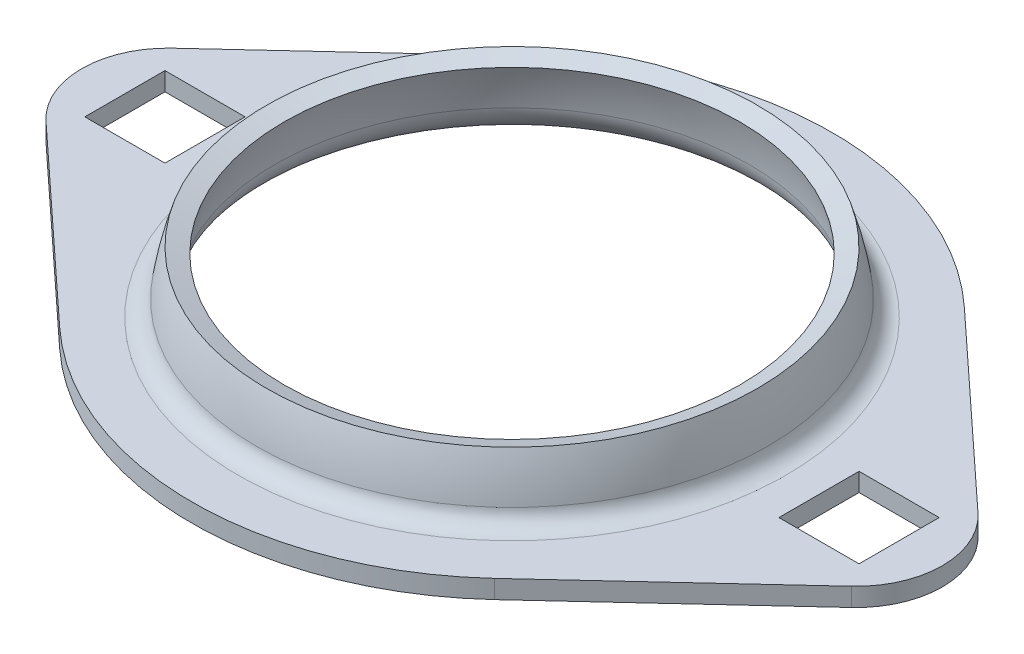
ISO-10303-21;
HEADER;
FILE_DESCRIPTION(('STEP AP214'),'2;1');
FILE_NAME('part.step','',(''),(''),'','','');
FILE_SCHEMA(('AUTOMOTIVE_DESIGN { 1 0 10303 214 1 1 1 1 }'));
ENDSEC;
DATA;
#1=APPLICATION_CONTEXT('core data for automotive mechanical design processes');
#2=APPLICATION_PROTOCOL_DEFINITION('international standard','automotive_design',2000,#1);
#3=PRODUCT_CONTEXT('',#1,'mechanical');
#4=PRODUCT('Part','Part','',(#3));
#5=PRODUCT_RELATED_PRODUCT_CATEGORY('part','',(#4));
#6=PRODUCT_DEFINITION_FORMATION('','',#4);
#7=PRODUCT_DEFINITION_CONTEXT('part definition',#1,'design');
#8=PRODUCT_DEFINITION('design','',#6,#7);
#9=PRODUCT_DEFINITION_SHAPE('','',#8);
#10=(LENGTH_UNIT() NAMED_UNIT(*) SI_UNIT(.MILLI.,.METRE.));
#11=(NAMED_UNIT(*) PLANE_ANGLE_UNIT() SI_UNIT($,.RADIAN.));
#12=(NAMED_UNIT(*) SI_UNIT($,.STERADIAN.) SOLID_ANGLE_UNIT());
#13=UNCERTAINTY_MEASURE_WITH_UNIT(LENGTH_MEASURE(1.E-05),#10,'distance_accuracy_value','');
#14=(GEOMETRIC_REPRESENTATION_CONTEXT(3) GLOBAL_UNCERTAINTY_ASSIGNED_CONTEXT((#13)) GLOBAL_UNIT_ASSIGNED_CONTEXT((#10,
#11,#12)) REPRESENTATION_CONTEXT('',''));
#15=CARTESIAN_POINT('',(0.,0.,0.));
#16=DIRECTION('',(0.,0.,1.));
#17=DIRECTION('',(1.,0.,0.));
#18=AXIS2_PLACEMENT_3D('',#15,#16,#17);
#19=CARTESIAN_POINT('',(34.75,10.5,0.));
#20=DIRECTION('',(0.,1.,0.));
#21=DIRECTION('',(0.,0.,1.));
#22=AXIS2_PLACEMENT_3D('',#19,#20,#21);
#23=PLANE('',#22);
#24=DIRECTION('',(0.,0.,1.));
#25=VECTOR('',#24,1.);
#26=CARTESIAN_POINT('',(-42.0249999999999,10.5,0.));
#27=LINE('',#26,#25);
#28=CARTESIAN_POINT('',(-42.0249999999999,10.5,-4.35));
#29=VERTEX_POINT('',#28);
#30=CARTESIAN_POINT('',(-42.0249999999999,10.5,4.35));
#31=VERTEX_POINT('',#30);
#32=EDGE_CURVE('E245',#29,#31,#27,.T.);
#33=ORIENTED_EDGE('',*,*,#32,.F.);
#34=DIRECTION('',(-1.,0.,0.));
#35=VECTOR('',#34,1.);
#36=CARTESIAN_POINT('',(34.75,10.5,-4.35000000000002));
#37=LINE('',#36,#35);
#38=CARTESIAN_POINT('',(-33.3249999999999,10.5,-4.35));
#39=VERTEX_POINT('',#38);
#40=EDGE_CURVE('E239',#39,#29,#37,.T.);
#41=ORIENTED_EDGE('',*,*,#40,.F.);
#42=DIRECTION('',(0.,0.,1.));
#43=VECTOR('',#42,1.);
#44=CARTESIAN_POINT('',(-33.3249999999999,10.5,0.));
#45=LINE('',#44,#43);
#46=CARTESIAN_POINT('',(-33.3249999999999,10.5,4.35));
#47=VERTEX_POINT('',#46);
#48=EDGE_CURVE('E184',#39,#47,#45,.T.);
#49=ORIENTED_EDGE('',*,*,#48,.T.);
#50=DIRECTION('',(-1.,0.,0.));
#51=VECTOR('',#50,1.);
#52=CARTESIAN_POINT('',(34.75,10.5,4.35));
#53=LINE('',#52,#51);
#54=EDGE_CURVE('E242',#47,#31,#53,.T.);
#55=ORIENTED_EDGE('',*,*,#54,.T.);
#56=EDGE_LOOP('',(#33,#41,#49,#55));
#57=FACE_BOUND('',#56,.T.);
#58=CARTESIAN_POINT('',(0.,10.5,0.));
#59=DIRECTION('',(0.,-1.,0.));
#60=DIRECTION('',(0.,0.,-1.));
#61=AXIS2_PLACEMENT_3D('',#58,#59,#60);
#62=CIRCLE('',#61,29.732137494637);
#63=CARTESIAN_POINT('',(0.,10.5,-29.732137494637));
#64=VERTEX_POINT('',#63);
#65=EDGE_CURVE('E299',#64,#64,#62,.T.);
#66=ORIENTED_EDGE('',*,*,#65,.T.);
#67=EDGE_LOOP('',(#66));
#68=FACE_BOUND('',#67,.T.);
#69=CARTESIAN_POINT('',(0.,10.5,0.));
#70=DIRECTION('',(0.,-1.,0.));
#71=DIRECTION('',(0.,0.,-1.));
#72=AXIS2_PLACEMENT_3D('',#69,#70,#71);
#73=CIRCLE('',#72,34.75);
#74=CARTESIAN_POINT('',(23.6149334236567,10.5,25.4930857174304));
#75=VERTEX_POINT('',#74);
#76=CARTESIAN_POINT('',(-23.6149334236569,10.5,25.4930857174304));
#77=VERTEX_POINT('',#76);
#78=EDGE_CURVE('E12',#75,#77,#73,.T.);
#79=ORIENTED_EDGE('',*,*,#78,.F.);
#80=DIRECTION('',(0.733613977480021,0.,-0.679566429457741));
#81=VECTOR('',#80,1.);
#82=CARTESIAN_POINT('',(23.6149334236567,10.5,25.4930857174304));
#83=LINE('',#82,#81);
#84=CARTESIAN_POINT('',(43.7277414164133,10.5,6.86204877759941));
#85=VERTEX_POINT('',#84);
#86=EDGE_CURVE('E260',#75,#85,#83,.T.);
#87=ORIENTED_EDGE('',*,*,#86,.T.);
#88=CARTESIAN_POINT('',(37.3712404094721,10.5,4.44089209850063E-13));
#89=DIRECTION('',(0.,1.,0.));
#90=DIRECTION('',(0.,0.,1.));
#91=AXIS2_PLACEMENT_3D('',#88,#89,#90);
#92=CIRCLE('',#91,9.35375959052785);
#93=CARTESIAN_POINT('',(43.7277414164133,10.5,-6.86204877759865));
#94=VERTEX_POINT('',#93);
#95=EDGE_CURVE('E279',#85,#94,#92,.T.);
#96=ORIENTED_EDGE('',*,*,#95,.T.);
#97=DIRECTION('',(0.733613977480009,0.,0.679566429457755));
#98=VECTOR('',#97,1.);
#99=CARTESIAN_POINT('',(23.6149334236571,10.5,-25.4930857174302));
#100=LINE('',#99,#98);
#101=CARTESIAN_POINT('',(23.6149334236571,10.5,-25.4930857174302));
#102=VERTEX_POINT('',#101);
#103=EDGE_CURVE('E256',#102,#94,#100,.T.);
#104=ORIENTED_EDGE('',*,*,#103,.F.);
#105=CARTESIAN_POINT('',(-23.6149334236569,10.5,-25.4930857174304));
#106=VERTEX_POINT('',#105);
#107=EDGE_CURVE('E74',#106,#102,#73,.T.);
#108=ORIENTED_EDGE('',*,*,#107,.F.);
#109=DIRECTION('',(-0.733613977480011,0.,0.679566429457752));
#110=VECTOR('',#109,1.);
#111=CARTESIAN_POINT('',(-23.6149334236569,10.5,-25.4930857174304));
#112=LINE('',#111,#110);
#113=CARTESIAN_POINT('',(-43.7277414164133,10.5,-6.86204877759888));
#114=VERTEX_POINT('',#113);
#115=EDGE_CURVE('E281',#106,#114,#112,.T.);
#116=ORIENTED_EDGE('',*,*,#115,.T.);
#117=CARTESIAN_POINT('',(-37.3712404094721,10.5,0.));
#118=DIRECTION('',(0.,1.,0.));
#119=DIRECTION('',(0.,0.,1.));
#120=AXIS2_PLACEMENT_3D('',#117,#118,#119);
#121=CIRCLE('',#120,9.35375959052777);
#122=CARTESIAN_POINT('',(-43.7277414164133,10.5,6.86204877759888));
#123=VERTEX_POINT('',#122);
#124=EDGE_CURVE('E265',#123,#114,#121,.F.);
#125=ORIENTED_EDGE('',*,*,#124,.F.);
#126=DIRECTION('',(-0.733613977480011,0.,-0.679566429457752));
#127=VECTOR('',#126,1.);
#128=CARTESIAN_POINT('',(-23.6149334236569,10.5,25.4930857174304));
#129=LINE('',#128,#127);
#130=EDGE_CURVE('E247',#77,#123,#129,.T.);
#131=ORIENTED_EDGE('',*,*,#130,.F.);
#132=EDGE_LOOP('',(#79,#87,#96,#104,#108,#116,#125,#131));
#133=FACE_BOUND('',#132,.T.);
#134=DIRECTION('',(1.,0.,0.));
#135=VECTOR('',#134,1.);
#136=CARTESIAN_POINT('',(34.75,10.5,-4.34999999999978));
#137=LINE('',#136,#135);
#138=CARTESIAN_POINT('',(33.3249999999999,10.5,-4.34999999999978));
#139=VERTEX_POINT('',#138);
#140=CARTESIAN_POINT('',(42.0249999999999,10.5,-4.34999999999978));
#141=VERTEX_POINT('',#140);
#142=EDGE_CURVE('E233',#139,#141,#137,.T.);
#143=ORIENTED_EDGE('',*,*,#142,.T.);
#144=DIRECTION('',(0.,0.,1.));
#145=VECTOR('',#144,1.);
#146=CARTESIAN_POINT('',(42.0249999999999,10.5,0.));
#147=LINE('',#146,#145);
#148=CARTESIAN_POINT('',(42.0249999999999,10.5,4.35000000000044));
#149=VERTEX_POINT('',#148);
#150=EDGE_CURVE('E236',#141,#149,#147,.T.);
#151=ORIENTED_EDGE('',*,*,#150,.T.);
#152=DIRECTION('',(1.,0.,0.));
#153=VECTOR('',#152,1.);
#154=CARTESIAN_POINT('',(34.75,10.5,4.35000000000044));
#155=LINE('',#154,#153);
#156=CARTESIAN_POINT('',(33.3249999999999,10.5,4.35000000000044));
#157=VERTEX_POINT('',#156);
#158=EDGE_CURVE('E208',#157,#149,#155,.T.);
#159=ORIENTED_EDGE('',*,*,#158,.F.);
#160=DIRECTION('',(0.,0.,1.));
#161=VECTOR('',#160,1.);
#162=CARTESIAN_POINT('',(33.3249999999999,10.5,0.));
#163=LINE('',#162,#161);
#164=EDGE_CURVE('E231',#139,#157,#163,.T.);
#165=ORIENTED_EDGE('',*,*,#164,.F.);
#166=EDGE_LOOP('',(#143,#151,#159,#165));
#167=FACE_BOUND('',#166,.T.);
#168=ADVANCED_FACE('F65',(#57,#68,#133,#167),#23,.T.);
#169=CARTESIAN_POINT('',(34.75,8.49999999999998,0.));
#170=DIRECTION('',(0.,1.,0.));
#171=DIRECTION('',(0.,0.,1.));
#172=AXIS2_PLACEMENT_3D('',#169,#170,#171);
#173=PLANE('',#172);
#174=DIRECTION('',(1.,0.,0.));
#175=VECTOR('',#174,1.);
#176=CARTESIAN_POINT('',(-42.0249999999999,8.49999999999998,-4.35));
#177=LINE('',#176,#175);
#178=CARTESIAN_POINT('',(-42.0249999999999,8.49999999999998,-4.35));
#179=VERTEX_POINT('',#178);
#180=CARTESIAN_POINT('',(-33.3249999999999,8.49999999999998,-4.35));
#181=VERTEX_POINT('',#180);
#182=EDGE_CURVE('E191',#179,#181,#177,.T.);
#183=ORIENTED_EDGE('',*,*,#182,.F.);
#184=DIRECTION('',(0.,0.,-1.));
#185=VECTOR('',#184,1.);
#186=CARTESIAN_POINT('',(-42.0249999999999,8.49999999999998,4.35));
#187=LINE('',#186,#185);
#188=CARTESIAN_POINT('',(-42.0249999999999,8.49999999999998,4.35));
#189=VERTEX_POINT('',#188);
#190=EDGE_CURVE('E196',#189,#179,#187,.T.);
#191=ORIENTED_EDGE('',*,*,#190,.F.);
#192=DIRECTION('',(1.,0.,0.));
#193=VECTOR('',#192,1.);
#194=CARTESIAN_POINT('',(-42.0249999999999,8.49999999999998,4.35));
#195=LINE('',#194,#193);
#196=CARTESIAN_POINT('',(-33.3249999999999,8.49999999999998,4.35));
#197=VERTEX_POINT('',#196);
#198=EDGE_CURVE('E201',#189,#197,#195,.T.);
#199=ORIENTED_EDGE('',*,*,#198,.T.);
#200=DIRECTION('',(0.,0.,-1.));
#201=VECTOR('',#200,1.);
#202=CARTESIAN_POINT('',(-33.3249999999999,8.49999999999998,4.35));
#203=LINE('',#202,#201);
#204=EDGE_CURVE('E181',#197,#181,#203,.T.);
#205=ORIENTED_EDGE('',*,*,#204,.T.);
#206=EDGE_LOOP('',(#183,#191,#199,#205));
#207=FACE_BOUND('',#206,.T.);
#208=CARTESIAN_POINT('',(0.,8.49999999999995,0.));
#209=DIRECTION('',(0.,-1.,0.));
#210=DIRECTION('',(0.,0.,-1.));
#211=AXIS2_PLACEMENT_3D('',#208,#209,#210);
#212=CIRCLE('',#211,34.75);
#213=CARTESIAN_POINT('',(-23.6149334236569,8.49999999999995,-25.4930857174304));
#214=VERTEX_POINT('',#213);
#215=CARTESIAN_POINT('',(23.6149334236571,8.49999999999995,-25.4930857174302));
#216=VERTEX_POINT('',#215);
#217=EDGE_CURVE('E69',#214,#216,#212,.T.);
#218=ORIENTED_EDGE('',*,*,#217,.T.);
#219=DIRECTION('',(0.733613977480009,0.,0.679566429457755));
#220=VECTOR('',#219,1.);
#221=CARTESIAN_POINT('',(23.6149334236571,8.49999999999998,-25.4930857174302));
#222=LINE('',#221,#220);
#223=CARTESIAN_POINT('',(43.7277414164133,8.49999999999998,-6.86204877759866));
#224=VERTEX_POINT('',#223);
#225=EDGE_CURVE('E257',#216,#224,#222,.T.);
#226=ORIENTED_EDGE('',*,*,#225,.T.);
#227=CARTESIAN_POINT('',(37.3712404094721,8.49999999999998,4.44089209850063E-13));
#228=DIRECTION('',(0.,1.,0.));
#229=DIRECTION('',(0.,0.,1.));
#230=AXIS2_PLACEMENT_3D('',#227,#228,#229);
#231=CIRCLE('',#230,9.35375959052785);
#232=CARTESIAN_POINT('',(43.7277414164133,8.49999999999998,6.86204877759941));
#233=VERTEX_POINT('',#232);
#234=EDGE_CURVE('E253',#233,#224,#231,.T.);
#235=ORIENTED_EDGE('',*,*,#234,.F.);
#236=DIRECTION('',(0.733613977480021,0.,-0.679566429457741));
#237=VECTOR('',#236,1.);
#238=CARTESIAN_POINT('',(23.6149334236567,8.49999999999998,25.4930857174304));
#239=LINE('',#238,#237);
#240=CARTESIAN_POINT('',(23.6149334236564,8.49999999999995,25.4930857174306));
#241=VERTEX_POINT('',#240);
#242=EDGE_CURVE('E248',#241,#233,#239,.T.);
#243=ORIENTED_EDGE('',*,*,#242,.F.);
#244=CARTESIAN_POINT('',(-23.6149334236569,8.49999999999995,25.4930857174304));
#245=VERTEX_POINT('',#244);
#246=EDGE_CURVE('E305',#241,#245,#212,.T.);
#247=ORIENTED_EDGE('',*,*,#246,.T.);
#248=DIRECTION('',(-0.733613977480011,0.,-0.679566429457752));
#249=VECTOR('',#248,1.);
#250=CARTESIAN_POINT('',(-23.6149334236569,8.49999999999998,25.4930857174304));
#251=LINE('',#250,#249);
#252=CARTESIAN_POINT('',(-43.7277414164133,8.49999999999998,6.86204877759888));
#253=VERTEX_POINT('',#252);
#254=EDGE_CURVE('E269',#245,#253,#251,.T.);
#255=ORIENTED_EDGE('',*,*,#254,.T.);
#256=CARTESIAN_POINT('',(-37.3712404094721,8.49999999999998,0.));
#257=DIRECTION('',(0.,-1.,0.));
#258=DIRECTION('',(0.,0.,-1.));
#259=AXIS2_PLACEMENT_3D('',#256,#257,#258);
#260=CIRCLE('',#259,9.35375959052777);
#261=CARTESIAN_POINT('',(-43.7277414164133,8.49999999999998,-6.86204877759888));
#262=VERTEX_POINT('',#261);
#263=EDGE_CURVE('E261',#253,#262,#260,.T.);
#264=ORIENTED_EDGE('',*,*,#263,.T.);
#265=DIRECTION('',(-0.733613977480011,0.,0.679566429457752));
#266=VECTOR('',#265,1.);
#267=CARTESIAN_POINT('',(-23.6149334236569,8.49999999999998,-25.4930857174304));
#268=LINE('',#267,#266);
#269=EDGE_CURVE('E262',#214,#262,#268,.T.);
#270=ORIENTED_EDGE('',*,*,#269,.F.);
#271=EDGE_LOOP('',(#218,#226,#235,#243,#247,#255,#264,#270));
#272=FACE_BOUND('',#271,.T.);
#273=CARTESIAN_POINT('',(0.,8.49999999999999,0.));
#274=DIRECTION('',(0.,-1.,0.));
#275=DIRECTION('',(0.,0.,-1.));
#276=AXIS2_PLACEMENT_3D('',#273,#274,#275);
#277=CIRCLE('',#276,29.732137494637);
#278=CARTESIAN_POINT('',(0.,8.49999999999999,-29.732137494637));
#279=VERTEX_POINT('',#278);
#280=EDGE_CURVE('E312',#279,#279,#277,.T.);
#281=ORIENTED_EDGE('',*,*,#280,.F.);
#282=EDGE_LOOP('',(#281));
#283=FACE_BOUND('',#282,.T.);
#284=DIRECTION('',(0.,0.,-1.));
#285=VECTOR('',#284,1.);
#286=CARTESIAN_POINT('',(42.0249999999999,8.49999999999998,4.35000000000044));
#287=LINE('',#286,#285);
#288=CARTESIAN_POINT('',(42.0249999999999,8.49999999999998,4.35000000000044));
#289=VERTEX_POINT('',#288);
#290=CARTESIAN_POINT('',(42.0249999999999,8.49999999999998,-4.34999999999978));
#291=VERTEX_POINT('',#290);
#292=EDGE_CURVE('E227',#289,#291,#287,.T.);
#293=ORIENTED_EDGE('',*,*,#292,.T.);
#294=DIRECTION('',(-1.,0.,0.));
#295=VECTOR('',#294,1.);
#296=CARTESIAN_POINT('',(42.0249999999999,8.49999999999998,-4.34999999999978));
#297=LINE('',#296,#295);
#298=CARTESIAN_POINT('',(33.3249999999999,8.49999999999998,-4.34999999999978));
#299=VERTEX_POINT('',#298);
#300=EDGE_CURVE('E224',#291,#299,#297,.T.);
#301=ORIENTED_EDGE('',*,*,#300,.T.);
#302=DIRECTION('',(0.,0.,-1.));
#303=VECTOR('',#302,1.);
#304=CARTESIAN_POINT('',(33.3249999999999,8.49999999999998,4.35000000000044));
#305=LINE('',#304,#303);
#306=CARTESIAN_POINT('',(33.3249999999999,8.49999999999998,4.35000000000044));
#307=VERTEX_POINT('',#306);
#308=EDGE_CURVE('E221',#307,#299,#305,.T.);
#309=ORIENTED_EDGE('',*,*,#308,.F.);
#310=DIRECTION('',(-1.,0.,0.));
#311=VECTOR('',#310,1.);
#312=CARTESIAN_POINT('',(42.0249999999999,8.49999999999998,4.35000000000044));
#313=LINE('',#312,#311);
#314=EDGE_CURVE('E219',#289,#307,#313,.T.);
#315=ORIENTED_EDGE('',*,*,#314,.F.);
#316=EDGE_LOOP('',(#293,#301,#309,#315));
#317=FACE_BOUND('',#316,.T.);
#318=ADVANCED_FACE('F198',(#207,#272,#283,#317),#173,.F.);
#319=CARTESIAN_POINT('',(0.,8.49999999999995,0.));
#320=DIRECTION('',(0.,1.,0.));
#321=DIRECTION('',(0.,0.,1.));
#322=AXIS2_PLACEMENT_3D('',#319,#320,#321);
#323=CYLINDRICAL_SURFACE('',#322,34.75);
#324=ORIENTED_EDGE('',*,*,#78,.T.);
#325=DIRECTION('',(0.,-1.,0.));
#326=VECTOR('',#325,1.);
#327=CARTESIAN_POINT('',(-23.6149334236568,126.960948390437,25.4930857174303));
#328=LINE('',#327,#326);
#329=EDGE_CURVE('E287',#77,#245,#328,.T.);
#330=ORIENTED_EDGE('',*,*,#329,.T.);
#331=ORIENTED_EDGE('',*,*,#246,.F.);
#332=DIRECTION('',(0.,-1.,0.));
#333=VECTOR('',#332,1.);
#334=CARTESIAN_POINT('',(23.6149334236567,126.960948390437,25.4930857174304));
#335=LINE('',#334,#333);
#336=EDGE_CURVE('E252',#75,#241,#335,.T.);
#337=ORIENTED_EDGE('',*,*,#336,.F.);
#338=EDGE_LOOP('',(#324,#330,#331,#337));
#339=FACE_BOUND('',#338,.T.);
#340=ADVANCED_FACE('F354',(#339),#323,.T.);
#341=ORIENTED_EDGE('',*,*,#107,.T.);
#342=DIRECTION('',(0.,-1.,0.));
#343=VECTOR('',#342,1.);
#344=CARTESIAN_POINT('',(23.6149334236571,126.960948390437,-25.4930857174302));
#345=LINE('',#344,#343);
#346=EDGE_CURVE('E293',#102,#216,#345,.T.);
#347=ORIENTED_EDGE('',*,*,#346,.T.);
#348=ORIENTED_EDGE('',*,*,#217,.F.);
#349=DIRECTION('',(0.,-1.,0.));
#350=VECTOR('',#349,1.);
#351=CARTESIAN_POINT('',(-23.6149334236569,126.960948390437,-25.4930857174304));
#352=LINE('',#351,#350);
#353=EDGE_CURVE('E266',#106,#214,#352,.T.);
#354=ORIENTED_EDGE('',*,*,#353,.F.);
#355=EDGE_LOOP('',(#341,#347,#348,#354));
#356=FACE_BOUND('',#355,.T.);
#357=ADVANCED_FACE('F341',(#356),#323,.T.);
#358=CARTESIAN_POINT('',(0.,16.5,0.));
#359=DIRECTION('',(0.,1.,0.));
#360=DIRECTION('',(0.,0.,1.));
#361=AXIS2_PLACEMENT_3D('',#358,#359,#360);
#362=CONICAL_SURFACE('',#361,24.7386337537059,1.25802960485335);
#363=CARTESIAN_POINT('',(0.,17.1153846153846,0.));
#364=DIRECTION('',(0.,-1.,0.));
#365=DIRECTION('',(0.,0.,-1.));
#366=AXIS2_PLACEMENT_3D('',#363,#364,#365);
#367=CIRCLE('',#366,26.6416055809141);
#368=CARTESIAN_POINT('',(26.6416055809141,17.1153846153846,0.));
#369=VERTEX_POINT('',#368);
#370=EDGE_CURVE('E302',#369,#369,#367,.T.);
#371=ORIENTED_EDGE('',*,*,#370,.F.);
#372=EDGE_LOOP('',(#371));
#373=FACE_BOUND('',#372,.T.);
#374=CARTESIAN_POINT('',(0.,16.5,0.));
#375=DIRECTION('',(0.,-1.,0.));
#376=DIRECTION('',(0.,0.,-1.));
#377=AXIS2_PLACEMENT_3D('',#374,#375,#376);
#378=CIRCLE('',#377,24.7386337537059);
#379=CARTESIAN_POINT('',(24.7386337537059,16.5,0.));
#380=VERTEX_POINT('',#379);
#381=EDGE_CURVE('E309',#380,#380,#378,.T.);
#382=ORIENTED_EDGE('',*,*,#381,.T.);
#383=EDGE_LOOP('',(#382));
#384=FACE_BOUND('',#383,.T.);
#385=ADVANCED_FACE('F67',(#373,#384),#362,.F.);
#386=CARTESIAN_POINT('',(0.,12.5,0.));
#387=DIRECTION('',(0.,-1.,0.));
#388=DIRECTION('',(0.,0.,-1.));
#389=AXIS2_PLACEMENT_3D('',#386,#387,#388);
#390=TOROIDAL_SURFACE('',#389,29.732137494637,2.);
#391=CARTESIAN_POINT('',(0.,12.2333333333333,0.));
#392=DIRECTION('',(0.,-1.,0.));
#393=DIRECTION('',(0.,0.,-1.));
#394=AXIS2_PLACEMENT_3D('',#391,#392,#393);
#395=CIRCLE('',#394,27.7499949949945);
#396=CARTESIAN_POINT('',(27.7499949949945,12.2333333333333,0.));
#397=VERTEX_POINT('',#396);
#398=EDGE_CURVE('E303',#397,#397,#395,.T.);
#399=ORIENTED_EDGE('',*,*,#398,.T.);
#400=EDGE_LOOP('',(#399));
#401=FACE_BOUND('',#400,.T.);
#402=ORIENTED_EDGE('',*,*,#65,.F.);
#403=EDGE_LOOP('',(#402));
#404=FACE_BOUND('',#403,.T.);
#405=ADVANCED_FACE('F402',(#401,#404),#390,.F.);
#406=CARTESIAN_POINT('',(0.,8.5,0.));
#407=DIRECTION('',(0.,-1.,0.));
#408=DIRECTION('',(1.,0.,0.));
#409=AXIS2_PLACEMENT_3D('',#406,#407,#408);
#410=SPHERICAL_SURFACE('',#409,28.);
#411=CARTESIAN_POINT('',(26.6416055809141,17.1153846153846,0.));
#412=CARTESIAN_POINT('',(26.6576728379628,17.0656993722769,0.));
#413=CARTESIAN_POINT('',(26.6736011012478,17.0159691812667,0.));
#414=CARTESIAN_POINT('',(26.7051791485745,16.9164204622886,0.));
#415=CARTESIAN_POINT('',(26.7208289326164,16.8666019343208,0.));
#416=CARTESIAN_POINT('',(26.7518495297415,16.7668781002746,0.));
#417=CARTESIAN_POINT('',(26.7672203428249,16.7169727941963,0.));
#418=CARTESIAN_POINT('',(26.7976825173857,16.6170769662338,0.));
#419=CARTESIAN_POINT('',(26.8127738788632,16.5670864443496,0.));
#420=CARTESIAN_POINT('',(26.8426766776867,16.4670217495486,0.));
#421=CARTESIAN_POINT('',(26.8574881150326,16.4169475766319,0.));
#422=CARTESIAN_POINT('',(26.8868306019973,16.316717147211,0.));
#423=CARTESIAN_POINT('',(26.901361651616,16.2665608907069,0.));
#424=CARTESIAN_POINT('',(26.9301429082623,16.1661678641114,0.));
#425=CARTESIAN_POINT('',(26.9443931152898,16.1159310940201,0.));
#426=CARTESIAN_POINT('',(26.9726122406928,16.0153786127745,0.));
#427=CARTESIAN_POINT('',(26.9865811590683,15.9650629016203,0.));
#428=CARTESIAN_POINT('',(27.014237269908,15.8643541132433,0.));
#429=CARTESIAN_POINT('',(27.0279244623723,15.8139610360205,0.));
#430=CARTESIAN_POINT('',(27.0550166929501,15.7130990929227,0.));
#431=CARTESIAN_POINT('',(27.0684217310635,15.6626302270477,0.));
#432=CARTESIAN_POINT('',(27.0949492333319,15.561618286434,0.));
#433=CARTESIAN_POINT('',(27.1080716974867,15.5110752116953,0.));
#434=CARTESIAN_POINT('',(27.1340336410754,15.4099164354658,0.));
#435=CARTESIAN_POINT('',(27.1468731205091,15.359300733975,0.));
#436=CARTESIAN_POINT('',(27.172268692751,15.2579982886262,0.));
#437=CARTESIAN_POINT('',(27.1848247855591,15.2073115447682,0.));
#438=CARTESIAN_POINT('',(27.2096531915159,15.1058686012936,0.));
#439=CARTESIAN_POINT('',(27.2219255046646,15.055112401677,0.));
#440=CARTESIAN_POINT('',(27.2461859671516,14.9535321354682,0.));
#441=CARTESIAN_POINT('',(27.2581741164899,14.9027080688759,0.));
#442=CARTESIAN_POINT('',(27.2818658761003,14.8009936596228,0.));
#443=CARTESIAN_POINT('',(27.2935694863723,14.7501033169619,0.));
#444=CARTESIAN_POINT('',(27.3166918015007,14.6482579485535,0.));
#445=CARTESIAN_POINT('',(27.3281105063572,14.597302922806,0.));
#446=CARTESIAN_POINT('',(27.3506626532236,14.4953297832306,0.));
#447=CARTESIAN_POINT('',(27.3617960952334,14.4443116694027,0.));
#448=CARTESIAN_POINT('',(27.3837773679049,14.3422139506482,0.));
#449=CARTESIAN_POINT('',(27.3946251985665,14.2911343457214,0.));
#450=CARTESIAN_POINT('',(27.41603490898,14.1889152436751,0.));
#451=CARTESIAN_POINT('',(27.4265967887319,14.1377757465556,0.));
#452=CARTESIAN_POINT('',(27.4474342667155,14.0354384609045,0.));
#453=CARTESIAN_POINT('',(27.4577098649472,13.984240672373,0.));
#454=CARTESIAN_POINT('',(27.4779744582412,13.8817884065036,0.));
#455=CARTESIAN_POINT('',(27.4879634533034,13.8305339291657,0.));
#456=CARTESIAN_POINT('',(27.5076545275805,13.7279698900635,0.));
#457=CARTESIAN_POINT('',(27.5173566067953,13.6766603282992,0.));
#458=CARTESIAN_POINT('',(27.5364735456808,13.5739877264485,0.));
#459=CARTESIAN_POINT('',(27.5458884053515,13.5226246863621,0.));
#460=CARTESIAN_POINT('',(27.5644306104423,13.4198467356454,0.));
#461=CARTESIAN_POINT('',(27.5735579558624,13.3684318250152,0.));
#462=CARTESIAN_POINT('',(27.5915248467463,13.2655517426128,0.));
#463=CARTESIAN_POINT('',(27.6003643922102,13.2140865708408,0.));
#464=CARTESIAN_POINT('',(27.6177554064814,13.1111075771297,0.));
#465=CARTESIAN_POINT('',(27.6263068752888,13.0595937551906,0.));
#466=CARTESIAN_POINT('',(27.6431214685769,12.956519073645,0.));
#467=CARTESIAN_POINT('',(27.6513845930575,12.9049582140385,0.));
#468=CARTESIAN_POINT('',(27.667622239001,12.8017910711232,0.));
#469=CARTESIAN_POINT('',(27.6755967604637,12.7501847878145,0.));
#470=CARTESIAN_POINT('',(27.6912569508885,12.6469284129064,0.));
#471=CARTESIAN_POINT('',(27.6989426198504,12.5952783213071,0.));
#472=CARTESIAN_POINT('',(27.7140248641819,12.4919359465096,0.));
#473=CARTESIAN_POINT('',(27.7214214395515,12.4402436633114,0.));
#474=CARTESIAN_POINT('',(27.7359252670828,12.3368185236688,0.));
#475=CARTESIAN_POINT('',(27.7430325192445,12.2850856672244,0.));
#476=CARTESIAN_POINT('',(27.7499949949945,12.2333333333333,0.));
#477=B_SPLINE_CURVE_WITH_KNOTS('',3,(#411,#412,#413,#414,#415,#416,#417,#418,#419,#420,#421,
#422,#423,#424,#425,#426,#427,#428,#429,#430,#431,#432,#433,#434,#435,#436,#437,#438,#439,#440,
#441,#442,#443,#444,#445,#446,#447,#448,#449,#450,#451,#452,#453,#454,#455,#456,#457,#458,#459,
#460,#461,#462,#463,#464,#465,#466,#467,#468,#469,#470,#471,#472,#473,#474,#475,#476),
.UNSPECIFIED.,.F.,.F.,(4,2,2,2,2,2,2,2,2,2,2,2,2,2,2,2,2,2,2,2,2,2,2,2,2,2,2,2,2,2,2,2,4),(0.,
0.156655536644874,0.313311073289746,0.469966609934623,0.626622146579498,0.783277683224373,
0.939933219869248,1.09658875651412,1.253244293159,1.40989982980387,1.56655536644875,
1.72321090309362,1.8798664397385,2.03652197638337,2.19317751302825,2.34983304967312,
2.506488586318,2.66314412296287,2.81979965960775,2.97645519625262,3.1331107328975,
3.28976626954237,3.44642180618725,3.60307734283212,3.759732879477,3.91638841612187,
4.07304395276675,4.22969948941162,4.3863550260565,4.54301056270137,4.69966609934625,
4.85632163599112,5.012977172636),.UNSPECIFIED.);
#478=EDGE_CURVE('BSEAM405',#369,#397,#477,.T.);
#479=ORIENTED_EDGE('',*,*,#370,.T.);
#480=ORIENTED_EDGE('',*,*,#398,.F.);
#481=ORIENTED_EDGE('',*,*,#478,.T.);
#482=ORIENTED_EDGE('',*,*,#478,.F.);
#483=EDGE_LOOP('',(#479,#481,#480,#482));
#484=FACE_BOUND('',#483,.T.);
#485=ADVANCED_FACE('F405',(#484),#410,.T.);
#486=CARTESIAN_POINT('',(0.,12.5,0.));
#487=DIRECTION('',(0.,-1.,0.));
#488=DIRECTION('',(0.,0.,-1.));
#489=AXIS2_PLACEMENT_3D('',#486,#487,#488);
#490=TOROIDAL_SURFACE('',#489,29.732137494637,4.);
#491=CARTESIAN_POINT('',(0.,11.9666666666667,0.));
#492=DIRECTION('',(0.,-1.,0.));
#493=DIRECTION('',(0.,0.,-1.));
#494=AXIS2_PLACEMENT_3D('',#491,#492,#493);
#495=CIRCLE('',#494,25.7678524953521);
#496=CARTESIAN_POINT('',(25.7678524953521,11.9666666666667,0.));
#497=VERTEX_POINT('',#496);
#498=EDGE_CURVE('E286',#497,#497,#495,.T.);
#499=ORIENTED_EDGE('',*,*,#498,.F.);
#500=EDGE_LOOP('',(#499));
#501=FACE_BOUND('',#500,.T.);
#502=ORIENTED_EDGE('',*,*,#280,.T.);
#503=EDGE_LOOP('',(#502));
#504=FACE_BOUND('',#503,.T.);
#505=ADVANCED_FACE('F409',(#501,#504),#490,.T.);
#506=CARTESIAN_POINT('',(0.,8.5,0.));
#507=DIRECTION('',(0.,-1.,0.));
#508=DIRECTION('',(1.,0.,0.));
#509=AXIS2_PLACEMENT_3D('',#506,#507,#508);
#510=SPHERICAL_SURFACE('',#509,26.);
#511=CARTESIAN_POINT('',(24.7386337537059,16.5,0.));
#512=CARTESIAN_POINT('',(24.7535533495369,16.4538637028285,0.));
#513=CARTESIAN_POINT('',(24.7683438797301,16.4076856683191,0.));
#514=CARTESIAN_POINT('',(24.7976663522478,16.3152475721252,0.));
#515=CARTESIAN_POINT('',(24.8121982945723,16.2689875104407,0.));
#516=CARTESIAN_POINT('',(24.84100313476,16.1763868073978,0.));
#517=CARTESIAN_POINT('',(24.8552760326231,16.1300461660394,0.));
#518=CARTESIAN_POINT('',(24.8835623375724,16.0372857543599,0.));
#519=CARTESIAN_POINT('',(24.8975757446587,15.9908659840389,0.));
#520=CARTESIAN_POINT('',(24.9253426292805,15.897948767438,0.));
#521=CARTESIAN_POINT('',(24.939096106816,15.8514513211582,0.));
#522=CARTESIAN_POINT('',(24.9663427018547,15.7583802081245,0.));
#523=CARTESIAN_POINT('',(24.9798358193578,15.7118065413707,0.));
#524=CARTESIAN_POINT('',(25.0065612719578,15.6185844452463,0.));
#525=CARTESIAN_POINT('',(25.0197936070548,15.5719360158758,0.));
#526=CARTESIAN_POINT('',(25.0459970806433,15.4785658547192,0.));
#527=CARTESIAN_POINT('',(25.0589682191348,15.4318441229331,0.));
#528=CARTESIAN_POINT('',(25.084648893486,15.3383288194402,0.));
#529=CARTESIAN_POINT('',(25.0973584293457,15.2915352477333,0.));
#530=CARTESIAN_POINT('',(25.1225155005965,15.1978777291425,0.));
#531=CARTESIAN_POINT('',(25.1349630359876,15.1510137822586,0.));
#532=CARTESIAN_POINT('',(25.1595957166653,15.0572169802601,0.));
#533=CARTESIAN_POINT('',(25.171780861952,15.0102841251456,0.));
#534=CARTESIAN_POINT('',(25.1958883809985,14.9163509757897,0.));
#535=CARTESIAN_POINT('',(25.2078107547585,14.8693506815482,0.));
#536=CARTESIAN_POINT('',(25.2313923575545,14.7752841251529,0.));
#537=CARTESIAN_POINT('',(25.2430515865906,14.728217862999,0.));
#538=CARTESIAN_POINT('',(25.2661065349791,14.6340208440583,0.));
#539=CARTESIAN_POINT('',(25.2775022543314,14.5868900872715,0.));
#540=CARTESIAN_POINT('',(25.3000298266408,14.4925655543633,0.));
#541=CARTESIAN_POINT('',(25.3111616795978,14.4453717782419,0.));
#542=CARTESIAN_POINT('',(25.3331611706645,14.3509226839354,0.));
#543=CARTESIAN_POINT('',(25.3440288087742,14.3036673657504,0.));
#544=CARTESIAN_POINT('',(25.365499529965,14.209096666514,0.));
#545=CARTESIAN_POINT('',(25.376102613046,14.1617812854627,0.));
#546=CARTESIAN_POINT('',(25.397043892279,14.0670919415712,0.));
#547=CARTESIAN_POINT('',(25.4073820884311,14.0197179787311,0.));
#548=CARTESIAN_POINT('',(25.4277932701974,13.9249129541733,0.));
#549=CARTESIAN_POINT('',(25.4378662558118,13.8774818924556,0.));
#550=CARTESIAN_POINT('',(25.4577467011957,13.7825641548412,0.));
#551=CARTESIAN_POINT('',(25.4675541609653,13.7350774789445,0.));
#552=CARTESIAN_POINT('',(25.4869032476644,13.6400499994113,0.));
#553=CARTESIAN_POINT('',(25.4964448745938,13.5925091957749,0.));
#554=CARTESIAN_POINT('',(25.5152619969382,13.4973749488962,0.));
#555=CARTESIAN_POINT('',(25.5245374923532,13.4497815056539,0.));
#556=CARTESIAN_POINT('',(25.5428220613247,13.3545434693447,0.));
#557=CARTESIAN_POINT('',(25.5518311348814,13.3068988762778,0.));
#558=CARTESIAN_POINT('',(25.5695825781322,13.2115600317022,0.));
#559=CARTESIAN_POINT('',(25.5783249478264,13.1638657801934,0.));
#560=CARTESIAN_POINT('',(25.5955427096964,13.0684291116708,0.));
#561=CARTESIAN_POINT('',(25.6040181018722,13.020686694657,0.));
#562=CARTESIAN_POINT('',(25.6207016434073,12.9251551895691,0.));
#563=CARTESIAN_POINT('',(25.6289097927666,12.877366101495,0.));
#564=CARTESIAN_POINT('',(25.6450585917327,12.7817427501918,0.));
#565=CARTESIAN_POINT('',(25.6529992413396,12.7339084869627,0.));
#566=CARTESIAN_POINT('',(25.6686127922499,12.6381962826704,0.));
#567=CARTESIAN_POINT('',(25.6762856935534,12.5903183416072,0.));
#568=CARTESIAN_POINT('',(25.6913635076437,12.4945202803287,0.));
#569=CARTESIAN_POINT('',(25.6987684204306,12.4466001601135,0.));
#570=CARTESIAN_POINT('',(25.713310025825,12.350719240556,0.));
#571=CARTESIAN_POINT('',(25.7204467184325,12.3027584412137,0.));
#572=CARTESIAN_POINT('',(25.7344516595975,12.206797664616,0.));
#573=CARTESIAN_POINT('',(25.7413199081549,12.1587976873606,0.));
#574=CARTESIAN_POINT('',(25.7547877480054,12.0627600576925,0.));
#575=CARTESIAN_POINT('',(25.7613873392985,12.0147224052798,0.));
#576=CARTESIAN_POINT('',(25.7678524953521,11.9666666666667,0.));
#577=B_SPLINE_CURVE_WITH_KNOTS('',3,(#511,#512,#513,#514,#515,#516,#517,#518,#519,#520,#521,
#522,#523,#524,#525,#526,#527,#528,#529,#530,#531,#532,#533,#534,#535,#536,#537,#538,#539,#540,
#541,#542,#543,#544,#545,#546,#547,#548,#549,#550,#551,#552,#553,#554,#555,#556,#557,#558,#559,
#560,#561,#562,#563,#564,#565,#566,#567,#568,#569,#570,#571,#572,#573,#574,#575,#576),
.UNSPECIFIED.,.F.,.F.,(4,2,2,2,2,2,2,2,2,2,2,2,2,2,2,2,2,2,2,2,2,2,2,2,2,2,2,2,2,2,2,2,4),(0.,
0.145465855455954,0.290931710911909,0.436397566367866,0.581863421823818,0.727329277279775,
0.872795132735731,1.01826098819168,1.16372684364764,1.3091926991036,1.45465855455955,
1.60012441001551,1.74559026547146,1.89105612092742,2.03652197638337,2.18198783183933,
2.32745368729528,2.47291954275124,2.61838539820719,2.76385125366315,2.9093171091191,
3.05478296457506,3.20024882003101,3.34571467548697,3.49118053094293,3.63664638639888,
3.78211224185484,3.92757809731079,4.07304395276675,4.2185098082227,4.36397566367866,
4.50944151913461,4.65490737459057),.UNSPECIFIED.);
#578=EDGE_CURVE('BSEAM397',#380,#497,#577,.T.);
#579=ORIENTED_EDGE('',*,*,#381,.F.);
#580=ORIENTED_EDGE('',*,*,#498,.T.);
#581=ORIENTED_EDGE('',*,*,#578,.T.);
#582=ORIENTED_EDGE('',*,*,#578,.F.);
#583=EDGE_LOOP('',(#579,#581,#580,#582));
#584=FACE_BOUND('',#583,.T.);
#585=ADVANCED_FACE('F397',(#584),#510,.F.);
#586=CARTESIAN_POINT('',(37.3712404094721,126.960948390437,4.44089209850063E-13));
#587=DIRECTION('',(0.,-1.,0.));
#588=DIRECTION('',(0.,0.,-1.));
#589=AXIS2_PLACEMENT_3D('',#586,#587,#588);
#590=CYLINDRICAL_SURFACE('',#589,9.35375959052785);
#591=ORIENTED_EDGE('',*,*,#95,.F.);
#592=DIRECTION('',(0.,-1.,0.));
#593=VECTOR('',#592,1.);
#594=CARTESIAN_POINT('',(43.7277414164133,126.960948390437,6.86204877759941));
#595=LINE('',#594,#593);
#596=EDGE_CURVE('E251',#85,#233,#595,.T.);
#597=ORIENTED_EDGE('',*,*,#596,.T.);
#598=ORIENTED_EDGE('',*,*,#234,.T.);
#599=DIRECTION('',(0.,-1.,0.));
#600=VECTOR('',#599,1.);
#601=CARTESIAN_POINT('',(43.7277414164133,126.960948390437,-6.86204877759866));
#602=LINE('',#601,#600);
#603=EDGE_CURVE('E284',#94,#224,#602,.T.);
#604=ORIENTED_EDGE('',*,*,#603,.F.);
#605=EDGE_LOOP('',(#591,#597,#598,#604));
#606=FACE_BOUND('',#605,.T.);
#607=ADVANCED_FACE('F349',(#606),#590,.T.);
#608=CARTESIAN_POINT('',(23.6149334236571,126.960948390437,-25.4930857174302));
#609=DIRECTION('',(0.679566429457755,0.,-0.733613977480008));
#610=DIRECTION('',(-0.733613977480009,0.,-0.679566429457755));
#611=AXIS2_PLACEMENT_3D('',#608,#609,#610);
#612=PLANE('',#611);
#613=ORIENTED_EDGE('',*,*,#346,.F.);
#614=ORIENTED_EDGE('',*,*,#103,.T.);
#615=ORIENTED_EDGE('',*,*,#603,.T.);
#616=ORIENTED_EDGE('',*,*,#225,.F.);
#617=EDGE_LOOP('',(#613,#614,#615,#616));
#618=FACE_BOUND('',#617,.T.);
#619=ADVANCED_FACE('F345',(#618),#612,.T.);
#620=CARTESIAN_POINT('',(23.6149334236567,126.960948390437,25.4930857174304));
#621=DIRECTION('',(-0.679566429457741,0.,-0.733613977480021));
#622=DIRECTION('',(-0.733613977480021,0.,0.679566429457741));
#623=AXIS2_PLACEMENT_3D('',#620,#621,#622);
#624=PLANE('',#623);
#625=ORIENTED_EDGE('',*,*,#86,.F.);
#626=ORIENTED_EDGE('',*,*,#336,.T.);
#627=ORIENTED_EDGE('',*,*,#242,.T.);
#628=ORIENTED_EDGE('',*,*,#596,.F.);
#629=EDGE_LOOP('',(#625,#626,#627,#628));
#630=FACE_BOUND('',#629,.T.);
#631=ADVANCED_FACE('F353',(#630),#624,.F.);
#632=CARTESIAN_POINT('',(-23.6149334236569,126.960948390437,25.4930857174304));
#633=DIRECTION('',(-0.679566429457752,0.,0.733613977480011));
#634=DIRECTION('',(0.733613977480011,0.,0.679566429457752));
#635=AXIS2_PLACEMENT_3D('',#632,#633,#634);
#636=PLANE('',#635);
#637=ORIENTED_EDGE('',*,*,#329,.F.);
#638=ORIENTED_EDGE('',*,*,#130,.T.);
#639=DIRECTION('',(0.,-1.,0.));
#640=VECTOR('',#639,1.);
#641=CARTESIAN_POINT('',(-43.7277414164133,126.960948390437,6.86204877759888));
#642=LINE('',#641,#640);
#643=EDGE_CURVE('E277',#123,#253,#642,.T.);
#644=ORIENTED_EDGE('',*,*,#643,.T.);
#645=ORIENTED_EDGE('',*,*,#254,.F.);
#646=EDGE_LOOP('',(#637,#638,#644,#645));
#647=FACE_BOUND('',#646,.T.);
#648=ADVANCED_FACE('F329',(#647),#636,.T.);
#649=CARTESIAN_POINT('',(-23.6149334236569,126.960948390437,-25.4930857174304));
#650=DIRECTION('',(0.679566429457752,0.,0.733613977480011));
#651=DIRECTION('',(0.733613977480011,0.,-0.679566429457752));
#652=AXIS2_PLACEMENT_3D('',#649,#650,#651);
#653=PLANE('',#652);
#654=ORIENTED_EDGE('',*,*,#115,.F.);
#655=ORIENTED_EDGE('',*,*,#353,.T.);
#656=ORIENTED_EDGE('',*,*,#269,.T.);
#657=DIRECTION('',(0.,-1.,0.));
#658=VECTOR('',#657,1.);
#659=CARTESIAN_POINT('',(-43.7277414164133,126.960948390437,-6.86204877759888));
#660=LINE('',#659,#658);
#661=EDGE_CURVE('E272',#114,#262,#660,.T.);
#662=ORIENTED_EDGE('',*,*,#661,.F.);
#663=EDGE_LOOP('',(#654,#655,#656,#662));
#664=FACE_BOUND('',#663,.T.);
#665=ADVANCED_FACE('F338',(#664),#653,.F.);
#666=CARTESIAN_POINT('',(-37.3712404094721,126.960948390437,0.));
#667=DIRECTION('',(0.,-1.,0.));
#668=DIRECTION('',(0.,0.,-1.));
#669=AXIS2_PLACEMENT_3D('',#666,#667,#668);
#670=CYLINDRICAL_SURFACE('',#669,9.35375959052777);
#671=ORIENTED_EDGE('',*,*,#643,.F.);
#672=ORIENTED_EDGE('',*,*,#124,.T.);
#673=ORIENTED_EDGE('',*,*,#661,.T.);
#674=ORIENTED_EDGE('',*,*,#263,.F.);
#675=EDGE_LOOP('',(#671,#672,#673,#674));
#676=FACE_BOUND('',#675,.T.);
#677=ADVANCED_FACE('F334',(#676),#670,.T.);
#678=CARTESIAN_POINT('',(42.0249999999999,17.1153846153846,4.35000000000044));
#679=DIRECTION('',(-1.,0.,0.));
#680=DIRECTION('',(0.,0.,1.));
#681=AXIS2_PLACEMENT_3D('',#678,#679,#680);
#682=PLANE('',#681);
#683=DIRECTION('',(0.,-1.,0.));
#684=VECTOR('',#683,1.);
#685=CARTESIAN_POINT('',(42.0249999999999,17.1153846153846,-4.34999999999978));
#686=LINE('',#685,#684);
#687=EDGE_CURVE('E211',#141,#291,#686,.T.);
#688=ORIENTED_EDGE('',*,*,#687,.T.);
#689=ORIENTED_EDGE('',*,*,#292,.F.);
#690=DIRECTION('',(0.,-1.,0.));
#691=VECTOR('',#690,1.);
#692=CARTESIAN_POINT('',(42.0249999999999,17.1153846153846,4.35000000000044));
#693=LINE('',#692,#691);
#694=EDGE_CURVE('E216',#149,#289,#693,.T.);
#695=ORIENTED_EDGE('',*,*,#694,.F.);
#696=ORIENTED_EDGE('',*,*,#150,.F.);
#697=EDGE_LOOP('',(#688,#689,#695,#696));
#698=FACE_BOUND('',#697,.T.);
#699=ADVANCED_FACE('F374',(#698),#682,.T.);
#700=CARTESIAN_POINT('',(42.0249999999999,17.1153846153846,-4.34999999999978));
#701=DIRECTION('',(0.,0.,1.));
#702=DIRECTION('',(1.,0.,0.));
#703=AXIS2_PLACEMENT_3D('',#700,#701,#702);
#704=PLANE('',#703);
#705=DIRECTION('',(0.,-1.,0.));
#706=VECTOR('',#705,1.);
#707=CARTESIAN_POINT('',(33.3249999999999,17.1153846153846,-4.34999999999978));
#708=LINE('',#707,#706);
#709=EDGE_CURVE('E213',#139,#299,#708,.T.);
#710=ORIENTED_EDGE('',*,*,#709,.T.);
#711=ORIENTED_EDGE('',*,*,#300,.F.);
#712=ORIENTED_EDGE('',*,*,#687,.F.);
#713=ORIENTED_EDGE('',*,*,#142,.F.);
#714=EDGE_LOOP('',(#710,#711,#712,#713));
#715=FACE_BOUND('',#714,.T.);
#716=ADVANCED_FACE('F365',(#715),#704,.T.);
#717=CARTESIAN_POINT('',(33.3249999999999,17.1153846153846,4.35000000000044));
#718=DIRECTION('',(-1.,0.,0.));
#719=DIRECTION('',(0.,0.,1.));
#720=AXIS2_PLACEMENT_3D('',#717,#718,#719);
#721=PLANE('',#720);
#722=ORIENTED_EDGE('',*,*,#164,.T.);
#723=DIRECTION('',(0.,-1.,0.));
#724=VECTOR('',#723,1.);
#725=CARTESIAN_POINT('',(33.3249999999999,17.1153846153846,4.35000000000044));
#726=LINE('',#725,#724);
#727=EDGE_CURVE('E90',#157,#307,#726,.T.);
#728=ORIENTED_EDGE('',*,*,#727,.T.);
#729=ORIENTED_EDGE('',*,*,#308,.T.);
#730=ORIENTED_EDGE('',*,*,#709,.F.);
#731=EDGE_LOOP('',(#722,#728,#729,#730));
#732=FACE_BOUND('',#731,.T.);
#733=ADVANCED_FACE('F368',(#732),#721,.F.);
#734=CARTESIAN_POINT('',(42.0249999999999,17.1153846153846,4.35000000000044));
#735=DIRECTION('',(0.,0.,1.));
#736=DIRECTION('',(1.,0.,0.));
#737=AXIS2_PLACEMENT_3D('',#734,#735,#736);
#738=PLANE('',#737);
#739=ORIENTED_EDGE('',*,*,#158,.T.);
#740=ORIENTED_EDGE('',*,*,#694,.T.);
#741=ORIENTED_EDGE('',*,*,#314,.T.);
#742=ORIENTED_EDGE('',*,*,#727,.F.);
#743=EDGE_LOOP('',(#739,#740,#741,#742));
#744=FACE_BOUND('',#743,.T.);
#745=ADVANCED_FACE('F375',(#744),#738,.F.);
#746=CARTESIAN_POINT('',(-42.0249999999999,17.1153846153846,4.35));
#747=DIRECTION('',(-1.,0.,0.));
#748=DIRECTION('',(0.,0.,1.));
#749=AXIS2_PLACEMENT_3D('',#746,#747,#748);
#750=PLANE('',#749);
#751=ORIENTED_EDGE('',*,*,#32,.T.);
#752=DIRECTION('',(0.,-1.,0.));
#753=VECTOR('',#752,1.);
#754=CARTESIAN_POINT('',(-42.0249999999999,17.1153846153846,4.35));
#755=LINE('',#754,#753);
#756=EDGE_CURVE('E206',#31,#189,#755,.T.);
#757=ORIENTED_EDGE('',*,*,#756,.T.);
#758=ORIENTED_EDGE('',*,*,#190,.T.);
#759=DIRECTION('',(0.,-1.,0.));
#760=VECTOR('',#759,1.);
#761=CARTESIAN_POINT('',(-42.0249999999999,17.1153846153846,-4.35));
#762=LINE('',#761,#760);
#763=EDGE_CURVE('E187',#29,#179,#762,.T.);
#764=ORIENTED_EDGE('',*,*,#763,.F.);
#765=EDGE_LOOP('',(#751,#757,#758,#764));
#766=FACE_BOUND('',#765,.T.);
#767=ADVANCED_FACE('F377',(#766),#750,.F.);
#768=CARTESIAN_POINT('',(-42.0249999999999,17.1153846153846,4.35));
#769=DIRECTION('',(0.,0.,-1.));
#770=DIRECTION('',(-1.,0.,0.));
#771=AXIS2_PLACEMENT_3D('',#768,#769,#770);
#772=PLANE('',#771);
#773=DIRECTION('',(0.,-1.,0.));
#774=VECTOR('',#773,1.);
#775=CARTESIAN_POINT('',(-33.3249999999999,17.1153846153846,4.35));
#776=LINE('',#775,#774);
#777=EDGE_CURVE('E186',#47,#197,#776,.T.);
#778=ORIENTED_EDGE('',*,*,#777,.T.);
#779=ORIENTED_EDGE('',*,*,#198,.F.);
#780=ORIENTED_EDGE('',*,*,#756,.F.);
#781=ORIENTED_EDGE('',*,*,#54,.F.);
#782=EDGE_LOOP('',(#778,#779,#780,#781));
#783=FACE_BOUND('',#782,.T.);
#784=ADVANCED_FACE('F383',(#783),#772,.T.);
#785=CARTESIAN_POINT('',(-33.3249999999999,17.1153846153846,4.35));
#786=DIRECTION('',(-1.,0.,0.));
#787=DIRECTION('',(0.,0.,1.));
#788=AXIS2_PLACEMENT_3D('',#785,#786,#787);
#789=PLANE('',#788);
#790=DIRECTION('',(0.,-1.,0.));
#791=VECTOR('',#790,1.);
#792=CARTESIAN_POINT('',(-33.3249999999999,17.1153846153846,-4.35));
#793=LINE('',#792,#791);
#794=EDGE_CURVE('E82',#39,#181,#793,.T.);
#795=ORIENTED_EDGE('',*,*,#794,.T.);
#796=ORIENTED_EDGE('',*,*,#204,.F.);
#797=ORIENTED_EDGE('',*,*,#777,.F.);
#798=ORIENTED_EDGE('',*,*,#48,.F.);
#799=EDGE_LOOP('',(#795,#796,#797,#798));
#800=FACE_BOUND('',#799,.T.);
#801=ADVANCED_FACE('F178',(#800),#789,.T.);
#802=CARTESIAN_POINT('',(-42.0249999999999,17.1153846153846,-4.35));
#803=DIRECTION('',(0.,0.,-1.));
#804=DIRECTION('',(-1.,0.,0.));
#805=AXIS2_PLACEMENT_3D('',#802,#803,#804);
#806=PLANE('',#805);
#807=ORIENTED_EDGE('',*,*,#40,.T.);
#808=ORIENTED_EDGE('',*,*,#763,.T.);
#809=ORIENTED_EDGE('',*,*,#182,.T.);
#810=ORIENTED_EDGE('',*,*,#794,.F.);
#811=EDGE_LOOP('',(#807,#808,#809,#810));
#812=FACE_BOUND('',#811,.T.);
#813=ADVANCED_FACE('F192',(#812),#806,.F.);
#814=CLOSED_SHELL('',(#168,#318,#340,#357,#385,#405,#485,#505,#585,#607,#619,#631,#648,#665,
#677,#699,#716,#733,#745,#767,#784,#801,#813));
#815=MANIFOLD_SOLID_BREP('B2',#814);
#816=ADVANCED_BREP_SHAPE_REPRESENTATION('',(#18,#815),#14);
#817=SHAPE_DEFINITION_REPRESENTATION(#9,#816);
ENDSEC;
END-ISO-10303-21;
